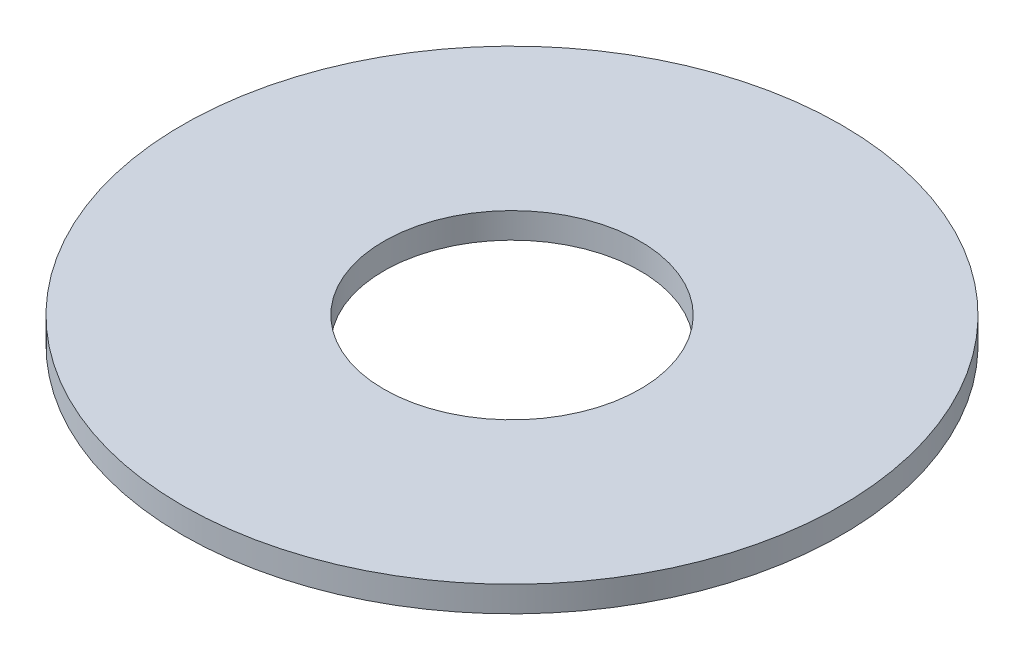
ISO-10303-21;
HEADER;
FILE_DESCRIPTION(('STEP AP214'),'2;1');
FILE_NAME('part.step','',(''),(''),'','','');
FILE_SCHEMA(('AUTOMOTIVE_DESIGN { 1 0 10303 214 1 1 1 1 }'));
ENDSEC;
DATA;
#1=APPLICATION_CONTEXT('core data for automotive mechanical design processes');
#2=APPLICATION_PROTOCOL_DEFINITION('international standard','automotive_design',2000,#1);
#3=PRODUCT_CONTEXT('',#1,'mechanical');
#4=PRODUCT('Part','Part','',(#3));
#5=PRODUCT_RELATED_PRODUCT_CATEGORY('part','',(#4));
#6=PRODUCT_DEFINITION_FORMATION('','',#4);
#7=PRODUCT_DEFINITION_CONTEXT('part definition',#1,'design');
#8=PRODUCT_DEFINITION('design','',#6,#7);
#9=PRODUCT_DEFINITION_SHAPE('','',#8);
#10=(LENGTH_UNIT() NAMED_UNIT(*) SI_UNIT(.MILLI.,.METRE.));
#11=(NAMED_UNIT(*) PLANE_ANGLE_UNIT() SI_UNIT($,.RADIAN.));
#12=(NAMED_UNIT(*) SI_UNIT($,.STERADIAN.) SOLID_ANGLE_UNIT());
#13=UNCERTAINTY_MEASURE_WITH_UNIT(LENGTH_MEASURE(1.E-05),#10,'distance_accuracy_value','');
#14=(GEOMETRIC_REPRESENTATION_CONTEXT(3) GLOBAL_UNCERTAINTY_ASSIGNED_CONTEXT((#13)) GLOBAL_UNIT_ASSIGNED_CONTEXT((#10,
#11,#12)) REPRESENTATION_CONTEXT('',''));
#15=CARTESIAN_POINT('',(0.,0.,0.));
#16=DIRECTION('',(0.,0.,1.));
#17=DIRECTION('',(1.,0.,0.));
#18=AXIS2_PLACEMENT_3D('',#15,#16,#17);
#19=CARTESIAN_POINT('',(0.,7.,0.));
#20=DIRECTION('',(0.,-1.,0.));
#21=DIRECTION('',(0.,0.,-1.));
#22=AXIS2_PLACEMENT_3D('',#19,#20,#21);
#23=CYLINDRICAL_SURFACE('',#22,90.);
#24=CARTESIAN_POINT('',(0.,7.,0.));
#25=DIRECTION('',(0.,1.,0.));
#26=DIRECTION('',(0.,0.,1.));
#27=AXIS2_PLACEMENT_3D('',#24,#25,#26);
#28=CIRCLE('',#27,90.);
#29=CARTESIAN_POINT('',(0.,7.,90.));
#30=VERTEX_POINT('',#29);
#31=EDGE_CURVE('E10',#30,#30,#28,.T.);
#32=ORIENTED_EDGE('',*,*,#31,.F.);
#33=EDGE_LOOP('',(#32));
#34=FACE_BOUND('',#33,.T.);
#35=CARTESIAN_POINT('',(0.,0.,0.));
#36=DIRECTION('',(0.,1.,0.));
#37=DIRECTION('',(0.,0.,1.));
#38=AXIS2_PLACEMENT_3D('',#35,#36,#37);
#39=CIRCLE('',#38,90.);
#40=CARTESIAN_POINT('',(0.,0.,90.));
#41=VERTEX_POINT('',#40);
#42=EDGE_CURVE('E37',#41,#41,#39,.T.);
#43=ORIENTED_EDGE('',*,*,#42,.T.);
#44=EDGE_LOOP('',(#43));
#45=FACE_BOUND('',#44,.T.);
#46=ADVANCED_FACE('F40',(#34,#45),#23,.T.);
#47=CARTESIAN_POINT('',(0.,7.,0.));
#48=DIRECTION('',(0.,1.,0.));
#49=DIRECTION('',(0.,0.,1.));
#50=AXIS2_PLACEMENT_3D('',#47,#48,#49);
#51=PLANE('',#50);
#52=CARTESIAN_POINT('',(0.,7.,0.));
#53=DIRECTION('',(0.,1.,0.));
#54=DIRECTION('',(0.,0.,1.));
#55=AXIS2_PLACEMENT_3D('',#52,#53,#54);
#56=CIRCLE('',#55,35.);
#57=CARTESIAN_POINT('',(0.,7.,35.));
#58=VERTEX_POINT('',#57);
#59=EDGE_CURVE('E50',#58,#58,#56,.T.);
#60=ORIENTED_EDGE('',*,*,#59,.F.);
#61=EDGE_LOOP('',(#60));
#62=FACE_BOUND('',#61,.T.);
#63=ORIENTED_EDGE('',*,*,#31,.T.);
#64=EDGE_LOOP('',(#63));
#65=FACE_BOUND('',#64,.T.);
#66=ADVANCED_FACE('F59',(#62,#65),#51,.T.);
#67=CARTESIAN_POINT('',(0.,0.,0.));
#68=DIRECTION('',(0.,1.,0.));
#69=DIRECTION('',(0.,0.,1.));
#70=AXIS2_PLACEMENT_3D('',#67,#68,#69);
#71=PLANE('',#70);
#72=CARTESIAN_POINT('',(0.,0.,0.));
#73=DIRECTION('',(0.,1.,0.));
#74=DIRECTION('',(0.,0.,1.));
#75=AXIS2_PLACEMENT_3D('',#72,#73,#74);
#76=CIRCLE('',#75,35.);
#77=CARTESIAN_POINT('',(0.,0.,35.));
#78=VERTEX_POINT('',#77);
#79=EDGE_CURVE('E47',#78,#78,#76,.T.);
#80=ORIENTED_EDGE('',*,*,#79,.T.);
#81=EDGE_LOOP('',(#80));
#82=FACE_BOUND('',#81,.T.);
#83=ORIENTED_EDGE('',*,*,#42,.F.);
#84=EDGE_LOOP('',(#83));
#85=FACE_BOUND('',#84,.T.);
#86=ADVANCED_FACE('F58',(#82,#85),#71,.F.);
#87=CARTESIAN_POINT('',(0.,7.,0.));
#88=DIRECTION('',(0.,-1.,0.));
#89=DIRECTION('',(0.,0.,-1.));
#90=AXIS2_PLACEMENT_3D('',#87,#88,#89);
#91=CYLINDRICAL_SURFACE('',#90,35.);
#92=ORIENTED_EDGE('',*,*,#59,.T.);
#93=EDGE_LOOP('',(#92));
#94=FACE_BOUND('',#93,.T.);
#95=ORIENTED_EDGE('',*,*,#79,.F.);
#96=EDGE_LOOP('',(#95));
#97=FACE_BOUND('',#96,.T.);
#98=ADVANCED_FACE('F54',(#94,#97),#91,.F.);
#99=CLOSED_SHELL('',(#46,#66,#86,#98));
#100=MANIFOLD_SOLID_BREP('B2',#99);
#101=ADVANCED_BREP_SHAPE_REPRESENTATION('',(#18,#100),#14);
#102=SHAPE_DEFINITION_REPRESENTATION(#9,#101);
ENDSEC;
END-ISO-10303-21;
